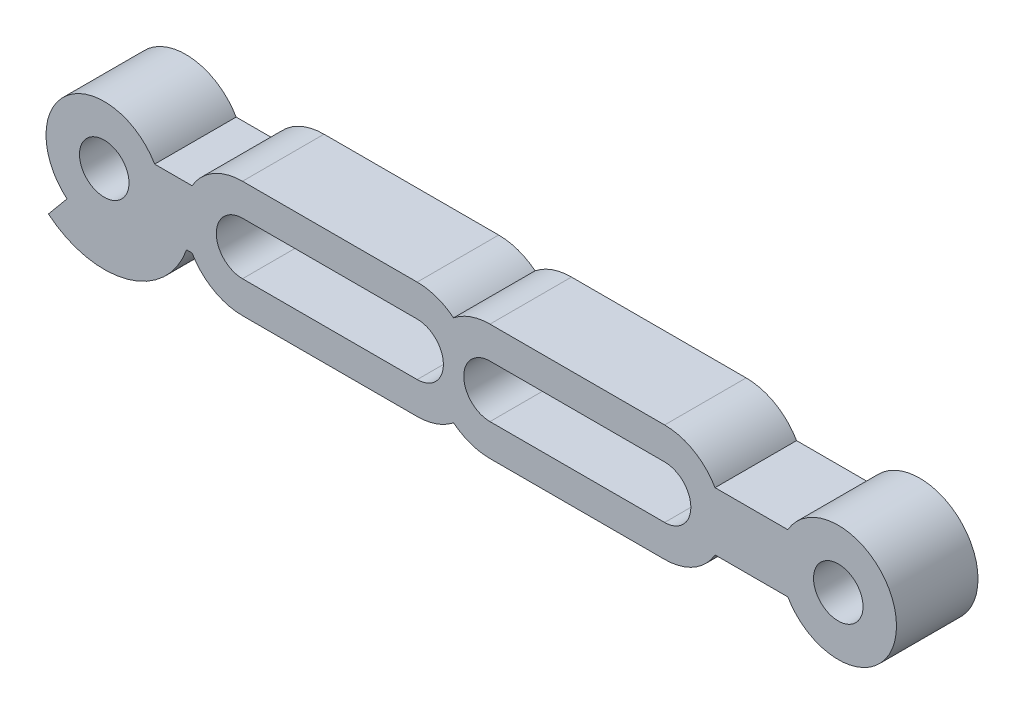
ISO-10303-21;
HEADER;
FILE_DESCRIPTION(('STEP AP214'),'2;1');
FILE_NAME('part.step','',(''),(''),'','','');
FILE_SCHEMA(('AUTOMOTIVE_DESIGN { 1 0 10303 214 1 1 1 1 }'));
ENDSEC;
DATA;
#1=APPLICATION_CONTEXT('core data for automotive mechanical design processes');
#2=APPLICATION_PROTOCOL_DEFINITION('international standard','automotive_design',2000,#1);
#3=PRODUCT_CONTEXT('',#1,'mechanical');
#4=PRODUCT('Part','Part','',(#3));
#5=PRODUCT_RELATED_PRODUCT_CATEGORY('part','',(#4));
#6=PRODUCT_DEFINITION_FORMATION('','',#4);
#7=PRODUCT_DEFINITION_CONTEXT('part definition',#1,'design');
#8=PRODUCT_DEFINITION('design','',#6,#7);
#9=PRODUCT_DEFINITION_SHAPE('','',#8);
#10=(LENGTH_UNIT() NAMED_UNIT(*) SI_UNIT(.MILLI.,.METRE.));
#11=(NAMED_UNIT(*) PLANE_ANGLE_UNIT() SI_UNIT($,.RADIAN.));
#12=(NAMED_UNIT(*) SI_UNIT($,.STERADIAN.) SOLID_ANGLE_UNIT());
#13=UNCERTAINTY_MEASURE_WITH_UNIT(LENGTH_MEASURE(1.E-05),#10,'distance_accuracy_value','');
#14=(GEOMETRIC_REPRESENTATION_CONTEXT(3) GLOBAL_UNCERTAINTY_ASSIGNED_CONTEXT((#13)) GLOBAL_UNIT_ASSIGNED_CONTEXT((#10,
#11,#12)) REPRESENTATION_CONTEXT('',''));
#15=CARTESIAN_POINT('',(0.,0.,0.));
#16=DIRECTION('',(0.,0.,1.));
#17=DIRECTION('',(1.,0.,0.));
#18=AXIS2_PLACEMENT_3D('',#15,#16,#17);
#19=CARTESIAN_POINT('',(29.,0.,5.6));
#20=DIRECTION('',(0.,0.,1.));
#21=DIRECTION('',(1.,0.,0.));
#22=AXIS2_PLACEMENT_3D('',#19,#20,#21);
#23=PLANE('',#22);
#24=CARTESIAN_POINT('',(40.9282032302755,0.,5.6));
#25=DIRECTION('',(0.,0.,1.));
#26=DIRECTION('',(1.,0.,0.));
#27=AXIS2_PLACEMENT_3D('',#24,#25,#26);
#28=CIRCLE('',#27,1.7);
#29=CARTESIAN_POINT('',(42.6282032302755,0.,5.6));
#30=VERTEX_POINT('',#29);
#31=EDGE_CURVE('E255',#30,#30,#28,.T.);
#32=ORIENTED_EDGE('',*,*,#31,.F.);
#33=EDGE_LOOP('',(#32));
#34=FACE_BOUND('',#33,.T.);
#35=CARTESIAN_POINT('',(29.,0.,5.6));
#36=DIRECTION('',(0.,0.,1.));
#37=DIRECTION('',(1.,0.,0.));
#38=AXIS2_PLACEMENT_3D('',#35,#36,#37);
#39=CIRCLE('',#38,4.);
#40=CARTESIAN_POINT('',(32.4641016151378,2.,5.6));
#41=VERTEX_POINT('',#40);
#42=CARTESIAN_POINT('',(29.,4.,5.6));
#43=VERTEX_POINT('',#42);
#44=EDGE_CURVE('E296',#41,#43,#39,.T.);
#45=ORIENTED_EDGE('',*,*,#44,.T.);
#46=DIRECTION('',(-1.,0.,0.));
#47=VECTOR('',#46,1.);
#48=CARTESIAN_POINT('',(17.,4.,5.6));
#49=LINE('',#48,#47);
#50=CARTESIAN_POINT('',(17.,4.,5.6));
#51=VERTEX_POINT('',#50);
#52=EDGE_CURVE('E299',#43,#51,#49,.T.);
#53=ORIENTED_EDGE('',*,*,#52,.T.);
#54=CARTESIAN_POINT('',(17.,0.,5.6));
#55=DIRECTION('',(0.,0.,1.));
#56=DIRECTION('',(1.,0.,0.));
#57=AXIS2_PLACEMENT_3D('',#54,#55,#56);
#58=CIRCLE('',#57,4.);
#59=CARTESIAN_POINT('',(14.5,3.1224989991992,5.6));
#60=VERTEX_POINT('',#59);
#61=EDGE_CURVE('E302',#51,#60,#58,.T.);
#62=ORIENTED_EDGE('',*,*,#61,.T.);
#63=CARTESIAN_POINT('',(12.,0.,5.6));
#64=DIRECTION('',(0.,0.,1.));
#65=DIRECTION('',(1.,0.,0.));
#66=AXIS2_PLACEMENT_3D('',#63,#64,#65);
#67=CIRCLE('',#66,4.);
#68=CARTESIAN_POINT('',(12.,4.,5.6));
#69=VERTEX_POINT('',#68);
#70=EDGE_CURVE('E304',#60,#69,#67,.T.);
#71=ORIENTED_EDGE('',*,*,#70,.T.);
#72=DIRECTION('',(-1.,0.,0.));
#73=VECTOR('',#72,1.);
#74=CARTESIAN_POINT('',(0.,4.,5.6));
#75=LINE('',#74,#73);
#76=CARTESIAN_POINT('',(0.,4.,5.6));
#77=VERTEX_POINT('',#76);
#78=EDGE_CURVE('E306',#69,#77,#75,.T.);
#79=ORIENTED_EDGE('',*,*,#78,.T.);
#80=CARTESIAN_POINT('',(0.,0.,5.6));
#81=DIRECTION('',(0.,0.,1.));
#82=DIRECTION('',(1.,0.,0.));
#83=AXIS2_PLACEMENT_3D('',#80,#81,#82);
#84=CIRCLE('',#83,4.);
#85=CARTESIAN_POINT('',(-3.46410161513775,2.,5.6));
#86=VERTEX_POINT('',#85);
#87=EDGE_CURVE('E308',#77,#86,#84,.T.);
#88=ORIENTED_EDGE('',*,*,#87,.T.);
#89=DIRECTION('',(-1.,0.,0.));
#90=VECTOR('',#89,1.);
#91=CARTESIAN_POINT('',(-3.84314575050762,2.,5.6));
#92=LINE('',#91,#90);
#93=CARTESIAN_POINT('',(-6.03589838486224,2.,5.6));
#94=VERTEX_POINT('',#93);
#95=EDGE_CURVE('E310',#86,#94,#92,.T.);
#96=ORIENTED_EDGE('',*,*,#95,.T.);
#97=CARTESIAN_POINT('',(-9.5,0.,5.6));
#98=DIRECTION('',(0.,0.,1.));
#99=DIRECTION('',(1.,0.,0.));
#100=AXIS2_PLACEMENT_3D('',#97,#98,#99);
#101=CIRCLE('',#100,4.);
#102=CARTESIAN_POINT('',(-12.0559528696348,-3.07686608876725,5.6));
#103=VERTEX_POINT('',#102);
#104=EDGE_CURVE('E312',#94,#103,#101,.T.);
#105=ORIENTED_EDGE('',*,*,#104,.T.);
#106=DIRECTION('',(-0.638988217408689,-0.769216522191812,0.));
#107=VECTOR('',#106,1.);
#108=CARTESIAN_POINT('',(-12.0559528696348,-3.07686608876725,5.6));
#109=LINE('',#108,#107);
#110=CARTESIAN_POINT('',(-13.3339293044521,-4.61529913315087,5.6));
#111=VERTEX_POINT('',#110);
#112=EDGE_CURVE('E314',#103,#111,#109,.T.);
#113=ORIENTED_EDGE('',*,*,#112,.T.);
#114=CARTESIAN_POINT('',(-9.5,0.,5.6));
#115=DIRECTION('',(0.,0.,1.));
#116=DIRECTION('',(1.,0.,0.));
#117=AXIS2_PLACEMENT_3D('',#114,#115,#116);
#118=CIRCLE('',#117,6.);
#119=CARTESIAN_POINT('',(-3.84314575050762,-2.,5.6));
#120=VERTEX_POINT('',#119);
#121=EDGE_CURVE('E316',#111,#120,#118,.T.);
#122=ORIENTED_EDGE('',*,*,#121,.T.);
#123=DIRECTION('',(1.,0.,0.));
#124=VECTOR('',#123,1.);
#125=CARTESIAN_POINT('',(-3.84314575050762,-2.,5.6));
#126=LINE('',#125,#124);
#127=CARTESIAN_POINT('',(-3.46410161513776,-2.,5.6));
#128=VERTEX_POINT('',#127);
#129=EDGE_CURVE('E318',#120,#128,#126,.T.);
#130=ORIENTED_EDGE('',*,*,#129,.T.);
#131=CARTESIAN_POINT('',(0.,0.,5.6));
#132=DIRECTION('',(0.,0.,1.));
#133=DIRECTION('',(1.,0.,0.));
#134=AXIS2_PLACEMENT_3D('',#131,#132,#133);
#135=CIRCLE('',#134,4.);
#136=CARTESIAN_POINT('',(0.,-4.,5.6));
#137=VERTEX_POINT('',#136);
#138=EDGE_CURVE('E320',#128,#137,#135,.T.);
#139=ORIENTED_EDGE('',*,*,#138,.T.);
#140=DIRECTION('',(1.,0.,0.));
#141=VECTOR('',#140,1.);
#142=CARTESIAN_POINT('',(0.,-4.,5.6));
#143=LINE('',#142,#141);
#144=CARTESIAN_POINT('',(12.,-4.,5.6));
#145=VERTEX_POINT('',#144);
#146=EDGE_CURVE('E322',#137,#145,#143,.T.);
#147=ORIENTED_EDGE('',*,*,#146,.T.);
#148=CARTESIAN_POINT('',(12.,0.,5.6));
#149=DIRECTION('',(0.,0.,1.));
#150=DIRECTION('',(1.,0.,0.));
#151=AXIS2_PLACEMENT_3D('',#148,#149,#150);
#152=CIRCLE('',#151,4.);
#153=CARTESIAN_POINT('',(14.5,-3.1224989991992,5.6));
#154=VERTEX_POINT('',#153);
#155=EDGE_CURVE('E324',#145,#154,#152,.T.);
#156=ORIENTED_EDGE('',*,*,#155,.T.);
#157=CARTESIAN_POINT('',(17.,0.,5.6));
#158=DIRECTION('',(0.,0.,1.));
#159=DIRECTION('',(1.,0.,0.));
#160=AXIS2_PLACEMENT_3D('',#157,#158,#159);
#161=CIRCLE('',#160,4.);
#162=CARTESIAN_POINT('',(17.,-4.,5.6));
#163=VERTEX_POINT('',#162);
#164=EDGE_CURVE('E326',#154,#163,#161,.T.);
#165=ORIENTED_EDGE('',*,*,#164,.T.);
#166=DIRECTION('',(1.,0.,0.));
#167=VECTOR('',#166,1.);
#168=CARTESIAN_POINT('',(17.,-4.,5.6));
#169=LINE('',#168,#167);
#170=CARTESIAN_POINT('',(29.,-4.,5.6));
#171=VERTEX_POINT('',#170);
#172=EDGE_CURVE('E328',#163,#171,#169,.T.);
#173=ORIENTED_EDGE('',*,*,#172,.T.);
#174=CARTESIAN_POINT('',(29.,0.,5.6));
#175=DIRECTION('',(0.,0.,1.));
#176=DIRECTION('',(1.,0.,0.));
#177=AXIS2_PLACEMENT_3D('',#174,#175,#176);
#178=CIRCLE('',#177,4.);
#179=CARTESIAN_POINT('',(32.4641016151378,-2.,5.6));
#180=VERTEX_POINT('',#179);
#181=EDGE_CURVE('E330',#171,#180,#178,.T.);
#182=ORIENTED_EDGE('',*,*,#181,.T.);
#183=DIRECTION('',(1.,0.,0.));
#184=VECTOR('',#183,1.);
#185=CARTESIAN_POINT('',(32.4641016151378,-2.,5.6));
#186=LINE('',#185,#184);
#187=CARTESIAN_POINT('',(37.4641016151377,-2.,5.6));
#188=VERTEX_POINT('',#187);
#189=EDGE_CURVE('E332',#180,#188,#186,.T.);
#190=ORIENTED_EDGE('',*,*,#189,.T.);
#191=CARTESIAN_POINT('',(40.9282032302755,0.,5.6));
#192=DIRECTION('',(0.,0.,1.));
#193=DIRECTION('',(1.,0.,0.));
#194=AXIS2_PLACEMENT_3D('',#191,#192,#193);
#195=CIRCLE('',#194,4.);
#196=CARTESIAN_POINT('',(37.4641016151377,2.,5.6));
#197=VERTEX_POINT('',#196);
#198=EDGE_CURVE('E334',#188,#197,#195,.T.);
#199=ORIENTED_EDGE('',*,*,#198,.T.);
#200=DIRECTION('',(-1.,0.,0.));
#201=VECTOR('',#200,1.);
#202=CARTESIAN_POINT('',(32.4641016151378,2.,5.6));
#203=LINE('',#202,#201);
#204=EDGE_CURVE('E336',#197,#41,#203,.T.);
#205=ORIENTED_EDGE('',*,*,#204,.T.);
#206=EDGE_LOOP('',(#45,#53,#62,#71,#79,#88,#96,#105,#113,#122,#130,#139,#147,#156,#165,#173,
#182,#190,#199,#205));
#207=FACE_BOUND('',#206,.T.);
#208=DIRECTION('',(1.,0.,0.));
#209=VECTOR('',#208,1.);
#210=CARTESIAN_POINT('',(17.,-1.8,5.6));
#211=LINE('',#210,#209);
#212=CARTESIAN_POINT('',(17.,-1.8,5.6));
#213=VERTEX_POINT('',#212);
#214=CARTESIAN_POINT('',(29.,-1.8,5.6));
#215=VERTEX_POINT('',#214);
#216=EDGE_CURVE('E267',#213,#215,#211,.T.);
#217=ORIENTED_EDGE('',*,*,#216,.F.);
#218=CARTESIAN_POINT('',(17.,0.,5.6));
#219=DIRECTION('',(0.,0.,1.));
#220=DIRECTION('',(1.,0.,0.));
#221=AXIS2_PLACEMENT_3D('',#218,#219,#220);
#222=CIRCLE('',#221,1.8);
#223=CARTESIAN_POINT('',(17.,1.8,5.6));
#224=VERTEX_POINT('',#223);
#225=EDGE_CURVE('E265',#224,#213,#222,.T.);
#226=ORIENTED_EDGE('',*,*,#225,.F.);
#227=DIRECTION('',(-1.,0.,0.));
#228=VECTOR('',#227,1.);
#229=CARTESIAN_POINT('',(17.,1.8,5.6));
#230=LINE('',#229,#228);
#231=CARTESIAN_POINT('',(29.,1.8,5.6));
#232=VERTEX_POINT('',#231);
#233=EDGE_CURVE('E273',#232,#224,#230,.T.);
#234=ORIENTED_EDGE('',*,*,#233,.F.);
#235=CARTESIAN_POINT('',(29.,0.,5.6));
#236=DIRECTION('',(0.,0.,1.));
#237=DIRECTION('',(1.,0.,0.));
#238=AXIS2_PLACEMENT_3D('',#235,#236,#237);
#239=CIRCLE('',#238,1.8);
#240=EDGE_CURVE('E270',#215,#232,#239,.T.);
#241=ORIENTED_EDGE('',*,*,#240,.F.);
#242=EDGE_LOOP('',(#217,#226,#234,#241));
#243=FACE_BOUND('',#242,.T.);
#244=DIRECTION('',(1.,0.,0.));
#245=VECTOR('',#244,1.);
#246=CARTESIAN_POINT('',(0.,-1.8,5.6));
#247=LINE('',#246,#245);
#248=CARTESIAN_POINT('',(0.,-1.8,5.6));
#249=VERTEX_POINT('',#248);
#250=CARTESIAN_POINT('',(12.,-1.8,5.6));
#251=VERTEX_POINT('',#250);
#252=EDGE_CURVE('E234',#249,#251,#247,.T.);
#253=ORIENTED_EDGE('',*,*,#252,.F.);
#254=CARTESIAN_POINT('',(0.,0.,5.6));
#255=DIRECTION('',(0.,0.,1.));
#256=DIRECTION('',(1.,0.,0.));
#257=AXIS2_PLACEMENT_3D('',#254,#255,#256);
#258=CIRCLE('',#257,1.8);
#259=CARTESIAN_POINT('',(0.,1.8,5.6));
#260=VERTEX_POINT('',#259);
#261=EDGE_CURVE('E226',#260,#249,#258,.T.);
#262=ORIENTED_EDGE('',*,*,#261,.F.);
#263=DIRECTION('',(-1.,0.,0.));
#264=VECTOR('',#263,1.);
#265=CARTESIAN_POINT('',(0.,1.8,5.6));
#266=LINE('',#265,#264);
#267=CARTESIAN_POINT('',(12.,1.8,5.6));
#268=VERTEX_POINT('',#267);
#269=EDGE_CURVE('E249',#268,#260,#266,.T.);
#270=ORIENTED_EDGE('',*,*,#269,.F.);
#271=CARTESIAN_POINT('',(12.,0.,5.6));
#272=DIRECTION('',(0.,0.,1.));
#273=DIRECTION('',(1.,0.,0.));
#274=AXIS2_PLACEMENT_3D('',#271,#272,#273);
#275=CIRCLE('',#274,1.8);
#276=EDGE_CURVE('E247',#251,#268,#275,.T.);
#277=ORIENTED_EDGE('',*,*,#276,.F.);
#278=EDGE_LOOP('',(#253,#262,#270,#277));
#279=FACE_BOUND('',#278,.T.);
#280=CARTESIAN_POINT('',(-9.5,0.,5.6));
#281=DIRECTION('',(0.,0.,1.));
#282=DIRECTION('',(1.,0.,0.));
#283=AXIS2_PLACEMENT_3D('',#280,#281,#282);
#284=CIRCLE('',#283,1.7);
#285=CARTESIAN_POINT('',(-7.8,0.,5.6));
#286=VERTEX_POINT('',#285);
#287=EDGE_CURVE('E814',#286,#286,#284,.T.);
#288=ORIENTED_EDGE('',*,*,#287,.F.);
#289=EDGE_LOOP('',(#288));
#290=FACE_BOUND('',#289,.T.);
#291=ADVANCED_FACE('F41',(#34,#207,#243,#279,#290),#23,.T.);
#292=CARTESIAN_POINT('',(29.,0.,0.));
#293=DIRECTION('',(0.,0.,1.));
#294=DIRECTION('',(1.,0.,0.));
#295=AXIS2_PLACEMENT_3D('',#292,#293,#294);
#296=PLANE('',#295);
#297=CARTESIAN_POINT('',(17.,0.,0.));
#298=DIRECTION('',(0.,0.,1.));
#299=DIRECTION('',(1.,0.,0.));
#300=AXIS2_PLACEMENT_3D('',#297,#298,#299);
#301=CIRCLE('',#300,1.8);
#302=CARTESIAN_POINT('',(17.,1.8,0.));
#303=VERTEX_POINT('',#302);
#304=CARTESIAN_POINT('',(17.,-1.8,0.));
#305=VERTEX_POINT('',#304);
#306=EDGE_CURVE('E242',#303,#305,#301,.T.);
#307=ORIENTED_EDGE('',*,*,#306,.T.);
#308=DIRECTION('',(1.,0.,0.));
#309=VECTOR('',#308,1.);
#310=CARTESIAN_POINT('',(17.,-1.8,0.));
#311=LINE('',#310,#309);
#312=CARTESIAN_POINT('',(29.,-1.8,0.));
#313=VERTEX_POINT('',#312);
#314=EDGE_CURVE('E278',#305,#313,#311,.T.);
#315=ORIENTED_EDGE('',*,*,#314,.T.);
#316=CARTESIAN_POINT('',(29.,0.,0.));
#317=DIRECTION('',(0.,0.,1.));
#318=DIRECTION('',(1.,0.,0.));
#319=AXIS2_PLACEMENT_3D('',#316,#317,#318);
#320=CIRCLE('',#319,1.8);
#321=CARTESIAN_POINT('',(29.,1.8,0.));
#322=VERTEX_POINT('',#321);
#323=EDGE_CURVE('E281',#313,#322,#320,.T.);
#324=ORIENTED_EDGE('',*,*,#323,.T.);
#325=DIRECTION('',(-1.,0.,0.));
#326=VECTOR('',#325,1.);
#327=CARTESIAN_POINT('',(17.,1.8,0.));
#328=LINE('',#327,#326);
#329=EDGE_CURVE('E268',#322,#303,#328,.T.);
#330=ORIENTED_EDGE('',*,*,#329,.T.);
#331=EDGE_LOOP('',(#307,#315,#324,#330));
#332=FACE_BOUND('',#331,.T.);
#333=CARTESIAN_POINT('',(29.,0.,0.));
#334=DIRECTION('',(0.,0.,1.));
#335=DIRECTION('',(1.,0.,0.));
#336=AXIS2_PLACEMENT_3D('',#333,#334,#335);
#337=CIRCLE('',#336,4.);
#338=CARTESIAN_POINT('',(32.4641016151378,2.,0.));
#339=VERTEX_POINT('',#338);
#340=CARTESIAN_POINT('',(29.,4.,0.));
#341=VERTEX_POINT('',#340);
#342=EDGE_CURVE('E295',#339,#341,#337,.T.);
#343=ORIENTED_EDGE('',*,*,#342,.F.);
#344=DIRECTION('',(-1.,0.,0.));
#345=VECTOR('',#344,1.);
#346=CARTESIAN_POINT('',(32.4641016151378,2.,0.));
#347=LINE('',#346,#345);
#348=CARTESIAN_POINT('',(37.4641016151377,2.,0.));
#349=VERTEX_POINT('',#348);
#350=EDGE_CURVE('E300',#349,#339,#347,.T.);
#351=ORIENTED_EDGE('',*,*,#350,.F.);
#352=CARTESIAN_POINT('',(40.9282032302755,0.,0.));
#353=DIRECTION('',(0.,0.,1.));
#354=DIRECTION('',(1.,0.,0.));
#355=AXIS2_PLACEMENT_3D('',#352,#353,#354);
#356=CIRCLE('',#355,4.);
#357=CARTESIAN_POINT('',(37.4641016151377,-2.,0.));
#358=VERTEX_POINT('',#357);
#359=EDGE_CURVE('E377',#358,#349,#356,.T.);
#360=ORIENTED_EDGE('',*,*,#359,.F.);
#361=DIRECTION('',(1.,0.,0.));
#362=VECTOR('',#361,1.);
#363=CARTESIAN_POINT('',(32.4641016151378,-2.,0.));
#364=LINE('',#363,#362);
#365=CARTESIAN_POINT('',(32.4641016151378,-2.,0.));
#366=VERTEX_POINT('',#365);
#367=EDGE_CURVE('E375',#366,#358,#364,.T.);
#368=ORIENTED_EDGE('',*,*,#367,.F.);
#369=CARTESIAN_POINT('',(29.,0.,0.));
#370=DIRECTION('',(0.,0.,1.));
#371=DIRECTION('',(1.,0.,0.));
#372=AXIS2_PLACEMENT_3D('',#369,#370,#371);
#373=CIRCLE('',#372,4.);
#374=CARTESIAN_POINT('',(29.,-4.,0.));
#375=VERTEX_POINT('',#374);
#376=EDGE_CURVE('E373',#375,#366,#373,.T.);
#377=ORIENTED_EDGE('',*,*,#376,.F.);
#378=DIRECTION('',(1.,0.,0.));
#379=VECTOR('',#378,1.);
#380=CARTESIAN_POINT('',(17.,-4.,0.));
#381=LINE('',#380,#379);
#382=CARTESIAN_POINT('',(17.,-4.,0.));
#383=VERTEX_POINT('',#382);
#384=EDGE_CURVE('E371',#383,#375,#381,.T.);
#385=ORIENTED_EDGE('',*,*,#384,.F.);
#386=CARTESIAN_POINT('',(17.,0.,0.));
#387=DIRECTION('',(0.,0.,1.));
#388=DIRECTION('',(1.,0.,0.));
#389=AXIS2_PLACEMENT_3D('',#386,#387,#388);
#390=CIRCLE('',#389,4.);
#391=CARTESIAN_POINT('',(14.5,-3.1224989991992,0.));
#392=VERTEX_POINT('',#391);
#393=EDGE_CURVE('E369',#392,#383,#390,.T.);
#394=ORIENTED_EDGE('',*,*,#393,.F.);
#395=CARTESIAN_POINT('',(12.,0.,0.));
#396=DIRECTION('',(0.,0.,1.));
#397=DIRECTION('',(1.,0.,0.));
#398=AXIS2_PLACEMENT_3D('',#395,#396,#397);
#399=CIRCLE('',#398,4.);
#400=CARTESIAN_POINT('',(12.,-4.,0.));
#401=VERTEX_POINT('',#400);
#402=EDGE_CURVE('E367',#401,#392,#399,.T.);
#403=ORIENTED_EDGE('',*,*,#402,.F.);
#404=DIRECTION('',(1.,0.,0.));
#405=VECTOR('',#404,1.);
#406=CARTESIAN_POINT('',(0.,-4.,0.));
#407=LINE('',#406,#405);
#408=CARTESIAN_POINT('',(0.,-4.,0.));
#409=VERTEX_POINT('',#408);
#410=EDGE_CURVE('E365',#409,#401,#407,.T.);
#411=ORIENTED_EDGE('',*,*,#410,.F.);
#412=CARTESIAN_POINT('',(0.,0.,0.));
#413=DIRECTION('',(0.,0.,1.));
#414=DIRECTION('',(1.,0.,0.));
#415=AXIS2_PLACEMENT_3D('',#412,#413,#414);
#416=CIRCLE('',#415,4.);
#417=CARTESIAN_POINT('',(-3.46410161513776,-2.,0.));
#418=VERTEX_POINT('',#417);
#419=EDGE_CURVE('E363',#418,#409,#416,.T.);
#420=ORIENTED_EDGE('',*,*,#419,.F.);
#421=DIRECTION('',(1.,0.,0.));
#422=VECTOR('',#421,1.);
#423=CARTESIAN_POINT('',(-3.84314575050762,-2.,0.));
#424=LINE('',#423,#422);
#425=CARTESIAN_POINT('',(-3.84314575050762,-2.,0.));
#426=VERTEX_POINT('',#425);
#427=EDGE_CURVE('E361',#426,#418,#424,.T.);
#428=ORIENTED_EDGE('',*,*,#427,.F.);
#429=CARTESIAN_POINT('',(-9.5,0.,0.));
#430=DIRECTION('',(0.,0.,1.));
#431=DIRECTION('',(1.,0.,0.));
#432=AXIS2_PLACEMENT_3D('',#429,#430,#431);
#433=CIRCLE('',#432,6.);
#434=CARTESIAN_POINT('',(-13.3339293044521,-4.61529913315087,0.));
#435=VERTEX_POINT('',#434);
#436=EDGE_CURVE('E359',#435,#426,#433,.T.);
#437=ORIENTED_EDGE('',*,*,#436,.F.);
#438=DIRECTION('',(-0.638988217408689,-0.769216522191812,0.));
#439=VECTOR('',#438,1.);
#440=CARTESIAN_POINT('',(-12.0559528696348,-3.07686608876725,0.));
#441=LINE('',#440,#439);
#442=CARTESIAN_POINT('',(-12.0559528696348,-3.07686608876725,0.));
#443=VERTEX_POINT('',#442);
#444=EDGE_CURVE('E357',#443,#435,#441,.T.);
#445=ORIENTED_EDGE('',*,*,#444,.F.);
#446=CARTESIAN_POINT('',(-9.5,0.,0.));
#447=DIRECTION('',(0.,0.,1.));
#448=DIRECTION('',(1.,0.,0.));
#449=AXIS2_PLACEMENT_3D('',#446,#447,#448);
#450=CIRCLE('',#449,4.);
#451=CARTESIAN_POINT('',(-6.03589838486224,2.,0.));
#452=VERTEX_POINT('',#451);
#453=EDGE_CURVE('E355',#452,#443,#450,.T.);
#454=ORIENTED_EDGE('',*,*,#453,.F.);
#455=DIRECTION('',(-1.,0.,0.));
#456=VECTOR('',#455,1.);
#457=CARTESIAN_POINT('',(-3.84314575050762,2.,0.));
#458=LINE('',#457,#456);
#459=CARTESIAN_POINT('',(-3.46410161513775,2.,0.));
#460=VERTEX_POINT('',#459);
#461=EDGE_CURVE('E352',#460,#452,#458,.T.);
#462=ORIENTED_EDGE('',*,*,#461,.F.);
#463=CARTESIAN_POINT('',(0.,0.,0.));
#464=DIRECTION('',(0.,0.,1.));
#465=DIRECTION('',(1.,0.,0.));
#466=AXIS2_PLACEMENT_3D('',#463,#464,#465);
#467=CIRCLE('',#466,4.);
#468=CARTESIAN_POINT('',(0.,4.,0.));
#469=VERTEX_POINT('',#468);
#470=EDGE_CURVE('E349',#469,#460,#467,.T.);
#471=ORIENTED_EDGE('',*,*,#470,.F.);
#472=DIRECTION('',(-1.,0.,0.));
#473=VECTOR('',#472,1.);
#474=CARTESIAN_POINT('',(0.,4.,0.));
#475=LINE('',#474,#473);
#476=CARTESIAN_POINT('',(12.,4.,0.));
#477=VERTEX_POINT('',#476);
#478=EDGE_CURVE('E347',#477,#469,#475,.T.);
#479=ORIENTED_EDGE('',*,*,#478,.F.);
#480=CARTESIAN_POINT('',(12.,0.,0.));
#481=DIRECTION('',(0.,0.,1.));
#482=DIRECTION('',(1.,0.,0.));
#483=AXIS2_PLACEMENT_3D('',#480,#481,#482);
#484=CIRCLE('',#483,4.);
#485=CARTESIAN_POINT('',(14.5,3.1224989991992,0.));
#486=VERTEX_POINT('',#485);
#487=EDGE_CURVE('E345',#486,#477,#484,.T.);
#488=ORIENTED_EDGE('',*,*,#487,.F.);
#489=CARTESIAN_POINT('',(17.,0.,0.));
#490=DIRECTION('',(0.,0.,1.));
#491=DIRECTION('',(1.,0.,0.));
#492=AXIS2_PLACEMENT_3D('',#489,#490,#491);
#493=CIRCLE('',#492,4.);
#494=CARTESIAN_POINT('',(17.,4.,0.));
#495=VERTEX_POINT('',#494);
#496=EDGE_CURVE('E343',#495,#486,#493,.T.);
#497=ORIENTED_EDGE('',*,*,#496,.F.);
#498=DIRECTION('',(-1.,0.,0.));
#499=VECTOR('',#498,1.);
#500=CARTESIAN_POINT('',(17.,4.,0.));
#501=LINE('',#500,#499);
#502=EDGE_CURVE('E341',#341,#495,#501,.T.);
#503=ORIENTED_EDGE('',*,*,#502,.F.);
#504=EDGE_LOOP('',(#343,#351,#360,#368,#377,#385,#394,#403,#411,#420,#428,#437,#445,#454,#462,
#471,#479,#488,#497,#503));
#505=FACE_BOUND('',#504,.T.);
#506=CARTESIAN_POINT('',(0.,0.,0.));
#507=DIRECTION('',(0.,0.,1.));
#508=DIRECTION('',(1.,0.,0.));
#509=AXIS2_PLACEMENT_3D('',#506,#507,#508);
#510=CIRCLE('',#509,1.8);
#511=CARTESIAN_POINT('',(0.,1.8,0.));
#512=VERTEX_POINT('',#511);
#513=CARTESIAN_POINT('',(0.,-1.8,0.));
#514=VERTEX_POINT('',#513);
#515=EDGE_CURVE('E64',#512,#514,#510,.T.);
#516=ORIENTED_EDGE('',*,*,#515,.T.);
#517=DIRECTION('',(1.,0.,0.));
#518=VECTOR('',#517,1.);
#519=CARTESIAN_POINT('',(0.,-1.8,0.));
#520=LINE('',#519,#518);
#521=CARTESIAN_POINT('',(12.,-1.8,0.));
#522=VERTEX_POINT('',#521);
#523=EDGE_CURVE('E241',#514,#522,#520,.T.);
#524=ORIENTED_EDGE('',*,*,#523,.T.);
#525=CARTESIAN_POINT('',(12.,0.,0.));
#526=DIRECTION('',(0.,0.,1.));
#527=DIRECTION('',(1.,0.,0.));
#528=AXIS2_PLACEMENT_3D('',#525,#526,#527);
#529=CIRCLE('',#528,1.8);
#530=CARTESIAN_POINT('',(12.,1.8,0.));
#531=VERTEX_POINT('',#530);
#532=EDGE_CURVE('E257',#522,#531,#529,.T.);
#533=ORIENTED_EDGE('',*,*,#532,.T.);
#534=DIRECTION('',(-1.,0.,0.));
#535=VECTOR('',#534,1.);
#536=CARTESIAN_POINT('',(0.,1.8,0.));
#537=LINE('',#536,#535);
#538=EDGE_CURVE('E235',#531,#512,#537,.T.);
#539=ORIENTED_EDGE('',*,*,#538,.T.);
#540=EDGE_LOOP('',(#516,#524,#533,#539));
#541=FACE_BOUND('',#540,.T.);
#542=CARTESIAN_POINT('',(40.9282032302755,0.,0.));
#543=DIRECTION('',(0.,0.,1.));
#544=DIRECTION('',(1.,0.,0.));
#545=AXIS2_PLACEMENT_3D('',#542,#543,#544);
#546=CIRCLE('',#545,1.7);
#547=CARTESIAN_POINT('',(42.6282032302755,0.,0.));
#548=VERTEX_POINT('',#547);
#549=EDGE_CURVE('E820',#548,#548,#546,.T.);
#550=ORIENTED_EDGE('',*,*,#549,.T.);
#551=EDGE_LOOP('',(#550));
#552=FACE_BOUND('',#551,.T.);
#553=CARTESIAN_POINT('',(-9.5,0.,0.));
#554=DIRECTION('',(0.,0.,1.));
#555=DIRECTION('',(1.,0.,0.));
#556=AXIS2_PLACEMENT_3D('',#553,#554,#555);
#557=CIRCLE('',#556,1.7);
#558=CARTESIAN_POINT('',(-7.8,0.,0.));
#559=VERTEX_POINT('',#558);
#560=EDGE_CURVE('E817',#559,#559,#557,.T.);
#561=ORIENTED_EDGE('',*,*,#560,.T.);
#562=EDGE_LOOP('',(#561));
#563=FACE_BOUND('',#562,.T.);
#564=ADVANCED_FACE('F443',(#332,#505,#541,#552,#563),#296,.F.);
#565=CARTESIAN_POINT('',(29.,0.,5.6));
#566=DIRECTION('',(0.,0.,-1.));
#567=DIRECTION('',(-1.,0.,0.));
#568=AXIS2_PLACEMENT_3D('',#565,#566,#567);
#569=CYLINDRICAL_SURFACE('',#568,4.);
#570=ORIENTED_EDGE('',*,*,#342,.T.);
#571=DIRECTION('',(0.,0.,-1.));
#572=VECTOR('',#571,1.);
#573=CARTESIAN_POINT('',(29.,4.,5.6));
#574=LINE('',#573,#572);
#575=EDGE_CURVE('E11',#43,#341,#574,.T.);
#576=ORIENTED_EDGE('',*,*,#575,.F.);
#577=ORIENTED_EDGE('',*,*,#44,.F.);
#578=DIRECTION('',(0.,0.,-1.));
#579=VECTOR('',#578,1.);
#580=CARTESIAN_POINT('',(32.4641016151378,2.,5.6));
#581=LINE('',#580,#579);
#582=EDGE_CURVE('E338',#41,#339,#581,.T.);
#583=ORIENTED_EDGE('',*,*,#582,.T.);
#584=EDGE_LOOP('',(#570,#576,#577,#583));
#585=FACE_BOUND('',#584,.T.);
#586=ADVANCED_FACE('F43',(#585),#569,.T.);
#587=CARTESIAN_POINT('',(17.,4.,5.6));
#588=DIRECTION('',(0.,-1.,0.));
#589=DIRECTION('',(0.,0.,-1.));
#590=AXIS2_PLACEMENT_3D('',#587,#588,#589);
#591=PLANE('',#590);
#592=ORIENTED_EDGE('',*,*,#502,.T.);
#593=DIRECTION('',(0.,0.,-1.));
#594=VECTOR('',#593,1.);
#595=CARTESIAN_POINT('',(17.,4.,5.6));
#596=LINE('',#595,#594);
#597=EDGE_CURVE('E49',#51,#495,#596,.T.);
#598=ORIENTED_EDGE('',*,*,#597,.F.);
#599=ORIENTED_EDGE('',*,*,#52,.F.);
#600=ORIENTED_EDGE('',*,*,#575,.T.);
#601=EDGE_LOOP('',(#592,#598,#599,#600));
#602=FACE_BOUND('',#601,.T.);
#603=ADVANCED_FACE('F461',(#602),#591,.F.);
#604=CARTESIAN_POINT('',(17.,0.,5.6));
#605=DIRECTION('',(0.,0.,-1.));
#606=DIRECTION('',(-1.,0.,0.));
#607=AXIS2_PLACEMENT_3D('',#604,#605,#606);
#608=CYLINDRICAL_SURFACE('',#607,4.);
#609=ORIENTED_EDGE('',*,*,#496,.T.);
#610=DIRECTION('',(0.,0.,-1.));
#611=VECTOR('',#610,1.);
#612=CARTESIAN_POINT('',(14.5,3.1224989991992,5.6));
#613=LINE('',#612,#611);
#614=EDGE_CURVE('E430',#60,#486,#613,.T.);
#615=ORIENTED_EDGE('',*,*,#614,.F.);
#616=ORIENTED_EDGE('',*,*,#61,.F.);
#617=ORIENTED_EDGE('',*,*,#597,.T.);
#618=EDGE_LOOP('',(#609,#615,#616,#617));
#619=FACE_BOUND('',#618,.T.);
#620=ADVANCED_FACE('F437',(#619),#608,.T.);
#621=CARTESIAN_POINT('',(12.,0.,5.6));
#622=DIRECTION('',(0.,0.,-1.));
#623=DIRECTION('',(-1.,0.,0.));
#624=AXIS2_PLACEMENT_3D('',#621,#622,#623);
#625=CYLINDRICAL_SURFACE('',#624,4.);
#626=ORIENTED_EDGE('',*,*,#487,.T.);
#627=DIRECTION('',(0.,0.,-1.));
#628=VECTOR('',#627,1.);
#629=CARTESIAN_POINT('',(12.,4.,5.6));
#630=LINE('',#629,#628);
#631=EDGE_CURVE('E427',#69,#477,#630,.T.);
#632=ORIENTED_EDGE('',*,*,#631,.F.);
#633=ORIENTED_EDGE('',*,*,#70,.F.);
#634=ORIENTED_EDGE('',*,*,#614,.T.);
#635=EDGE_LOOP('',(#626,#632,#633,#634));
#636=FACE_BOUND('',#635,.T.);
#637=ADVANCED_FACE('F449',(#636),#625,.T.);
#638=CARTESIAN_POINT('',(0.,4.,5.6));
#639=DIRECTION('',(0.,-1.,0.));
#640=DIRECTION('',(1.,0.,0.));
#641=AXIS2_PLACEMENT_3D('',#638,#639,#640);
#642=PLANE('',#641);
#643=ORIENTED_EDGE('',*,*,#478,.T.);
#644=DIRECTION('',(0.,0.,-1.));
#645=VECTOR('',#644,1.);
#646=CARTESIAN_POINT('',(0.,4.,5.6));
#647=LINE('',#646,#645);
#648=EDGE_CURVE('E424',#77,#469,#647,.T.);
#649=ORIENTED_EDGE('',*,*,#648,.F.);
#650=ORIENTED_EDGE('',*,*,#78,.F.);
#651=ORIENTED_EDGE('',*,*,#631,.T.);
#652=EDGE_LOOP('',(#643,#649,#650,#651));
#653=FACE_BOUND('',#652,.T.);
#654=ADVANCED_FACE('F453',(#653),#642,.F.);
#655=CARTESIAN_POINT('',(0.,0.,5.6));
#656=DIRECTION('',(0.,0.,-1.));
#657=DIRECTION('',(-1.,0.,0.));
#658=AXIS2_PLACEMENT_3D('',#655,#656,#657);
#659=CYLINDRICAL_SURFACE('',#658,4.);
#660=ORIENTED_EDGE('',*,*,#470,.T.);
#661=DIRECTION('',(0.,0.,-1.));
#662=VECTOR('',#661,1.);
#663=CARTESIAN_POINT('',(-3.46410161513775,2.,5.6));
#664=LINE('',#663,#662);
#665=EDGE_CURVE('E421',#86,#460,#664,.T.);
#666=ORIENTED_EDGE('',*,*,#665,.F.);
#667=ORIENTED_EDGE('',*,*,#87,.F.);
#668=ORIENTED_EDGE('',*,*,#648,.T.);
#669=EDGE_LOOP('',(#660,#666,#667,#668));
#670=FACE_BOUND('',#669,.T.);
#671=ADVANCED_FACE('F538',(#670),#659,.T.);
#672=CARTESIAN_POINT('',(-3.84314575050762,2.,5.6));
#673=DIRECTION('',(0.,-1.,0.));
#674=DIRECTION('',(1.,0.,0.));
#675=AXIS2_PLACEMENT_3D('',#672,#673,#674);
#676=PLANE('',#675);
#677=ORIENTED_EDGE('',*,*,#461,.T.);
#678=DIRECTION('',(0.,0.,-1.));
#679=VECTOR('',#678,1.);
#680=CARTESIAN_POINT('',(-6.03589838486224,2.,5.6));
#681=LINE('',#680,#679);
#682=EDGE_CURVE('E418',#94,#452,#681,.T.);
#683=ORIENTED_EDGE('',*,*,#682,.F.);
#684=ORIENTED_EDGE('',*,*,#95,.F.);
#685=ORIENTED_EDGE('',*,*,#665,.T.);
#686=EDGE_LOOP('',(#677,#683,#684,#685));
#687=FACE_BOUND('',#686,.T.);
#688=ADVANCED_FACE('F527',(#687),#676,.F.);
#689=CARTESIAN_POINT('',(-9.5,0.,5.6));
#690=DIRECTION('',(0.,0.,-1.));
#691=DIRECTION('',(-1.,0.,0.));
#692=AXIS2_PLACEMENT_3D('',#689,#690,#691);
#693=CYLINDRICAL_SURFACE('',#692,4.);
#694=ORIENTED_EDGE('',*,*,#453,.T.);
#695=DIRECTION('',(0.,0.,-1.));
#696=VECTOR('',#695,1.);
#697=CARTESIAN_POINT('',(-12.0559528696348,-3.07686608876725,5.6));
#698=LINE('',#697,#696);
#699=EDGE_CURVE('E415',#103,#443,#698,.T.);
#700=ORIENTED_EDGE('',*,*,#699,.F.);
#701=ORIENTED_EDGE('',*,*,#104,.F.);
#702=ORIENTED_EDGE('',*,*,#682,.T.);
#703=EDGE_LOOP('',(#694,#700,#701,#702));
#704=FACE_BOUND('',#703,.T.);
#705=ADVANCED_FACE('F530',(#704),#693,.T.);
#706=CARTESIAN_POINT('',(-12.0559528696348,-3.07686608876725,5.6));
#707=DIRECTION('',(0.769216522191811,-0.638988217408689,0.));
#708=DIRECTION('',(0.638988217408689,0.769216522191812,0.));
#709=AXIS2_PLACEMENT_3D('',#706,#707,#708);
#710=PLANE('',#709);
#711=ORIENTED_EDGE('',*,*,#444,.T.);
#712=DIRECTION('',(0.,0.,-1.));
#713=VECTOR('',#712,1.);
#714=CARTESIAN_POINT('',(-13.3339293044521,-4.61529913315087,5.6));
#715=LINE('',#714,#713);
#716=EDGE_CURVE('E412',#111,#435,#715,.T.);
#717=ORIENTED_EDGE('',*,*,#716,.F.);
#718=ORIENTED_EDGE('',*,*,#112,.F.);
#719=ORIENTED_EDGE('',*,*,#699,.T.);
#720=EDGE_LOOP('',(#711,#717,#718,#719));
#721=FACE_BOUND('',#720,.T.);
#722=ADVANCED_FACE('F522',(#721),#710,.F.);
#723=CARTESIAN_POINT('',(-9.5,0.,5.6));
#724=DIRECTION('',(0.,0.,-1.));
#725=DIRECTION('',(-1.,0.,0.));
#726=AXIS2_PLACEMENT_3D('',#723,#724,#725);
#727=CYLINDRICAL_SURFACE('',#726,6.);
#728=ORIENTED_EDGE('',*,*,#436,.T.);
#729=DIRECTION('',(0.,0.,-1.));
#730=VECTOR('',#729,1.);
#731=CARTESIAN_POINT('',(-3.84314575050762,-2.,5.6));
#732=LINE('',#731,#730);
#733=EDGE_CURVE('E409',#120,#426,#732,.T.);
#734=ORIENTED_EDGE('',*,*,#733,.F.);
#735=ORIENTED_EDGE('',*,*,#121,.F.);
#736=ORIENTED_EDGE('',*,*,#716,.T.);
#737=EDGE_LOOP('',(#728,#734,#735,#736));
#738=FACE_BOUND('',#737,.T.);
#739=ADVANCED_FACE('F518',(#738),#727,.T.);
#740=CARTESIAN_POINT('',(-3.84314575050762,-2.,5.6));
#741=DIRECTION('',(0.,1.,0.));
#742=DIRECTION('',(-1.,0.,0.));
#743=AXIS2_PLACEMENT_3D('',#740,#741,#742);
#744=PLANE('',#743);
#745=ORIENTED_EDGE('',*,*,#427,.T.);
#746=DIRECTION('',(0.,0.,-1.));
#747=VECTOR('',#746,1.);
#748=CARTESIAN_POINT('',(-3.46410161513776,-2.,5.6));
#749=LINE('',#748,#747);
#750=EDGE_CURVE('E406',#128,#418,#749,.T.);
#751=ORIENTED_EDGE('',*,*,#750,.F.);
#752=ORIENTED_EDGE('',*,*,#129,.F.);
#753=ORIENTED_EDGE('',*,*,#733,.T.);
#754=EDGE_LOOP('',(#745,#751,#752,#753));
#755=FACE_BOUND('',#754,.T.);
#756=ADVANCED_FACE('F513',(#755),#744,.F.);
#757=CARTESIAN_POINT('',(0.,0.,5.6));
#758=DIRECTION('',(0.,0.,-1.));
#759=DIRECTION('',(-1.,0.,0.));
#760=AXIS2_PLACEMENT_3D('',#757,#758,#759);
#761=CYLINDRICAL_SURFACE('',#760,4.);
#762=ORIENTED_EDGE('',*,*,#419,.T.);
#763=DIRECTION('',(0.,0.,-1.));
#764=VECTOR('',#763,1.);
#765=CARTESIAN_POINT('',(0.,-4.,5.6));
#766=LINE('',#765,#764);
#767=EDGE_CURVE('E403',#137,#409,#766,.T.);
#768=ORIENTED_EDGE('',*,*,#767,.F.);
#769=ORIENTED_EDGE('',*,*,#138,.F.);
#770=ORIENTED_EDGE('',*,*,#750,.T.);
#771=EDGE_LOOP('',(#762,#768,#769,#770));
#772=FACE_BOUND('',#771,.T.);
#773=ADVANCED_FACE('F507',(#772),#761,.T.);
#774=CARTESIAN_POINT('',(0.,-4.,5.6));
#775=DIRECTION('',(0.,1.,0.));
#776=DIRECTION('',(-1.,0.,0.));
#777=AXIS2_PLACEMENT_3D('',#774,#775,#776);
#778=PLANE('',#777);
#779=ORIENTED_EDGE('',*,*,#410,.T.);
#780=DIRECTION('',(0.,0.,-1.));
#781=VECTOR('',#780,1.);
#782=CARTESIAN_POINT('',(12.,-4.,5.6));
#783=LINE('',#782,#781);
#784=EDGE_CURVE('E400',#145,#401,#783,.T.);
#785=ORIENTED_EDGE('',*,*,#784,.F.);
#786=ORIENTED_EDGE('',*,*,#146,.F.);
#787=ORIENTED_EDGE('',*,*,#767,.T.);
#788=EDGE_LOOP('',(#779,#785,#786,#787));
#789=FACE_BOUND('',#788,.T.);
#790=ADVANCED_FACE('F503',(#789),#778,.F.);
#791=CARTESIAN_POINT('',(12.,0.,5.6));
#792=DIRECTION('',(0.,0.,-1.));
#793=DIRECTION('',(-1.,0.,0.));
#794=AXIS2_PLACEMENT_3D('',#791,#792,#793);
#795=CYLINDRICAL_SURFACE('',#794,4.);
#796=ORIENTED_EDGE('',*,*,#402,.T.);
#797=DIRECTION('',(0.,0.,-1.));
#798=VECTOR('',#797,1.);
#799=CARTESIAN_POINT('',(14.5,-3.1224989991992,5.6));
#800=LINE('',#799,#798);
#801=EDGE_CURVE('E397',#154,#392,#800,.T.);
#802=ORIENTED_EDGE('',*,*,#801,.F.);
#803=ORIENTED_EDGE('',*,*,#155,.F.);
#804=ORIENTED_EDGE('',*,*,#784,.T.);
#805=EDGE_LOOP('',(#796,#802,#803,#804));
#806=FACE_BOUND('',#805,.T.);
#807=ADVANCED_FACE('F498',(#806),#795,.T.);
#808=CARTESIAN_POINT('',(17.,0.,5.6));
#809=DIRECTION('',(0.,0.,-1.));
#810=DIRECTION('',(-1.,0.,0.));
#811=AXIS2_PLACEMENT_3D('',#808,#809,#810);
#812=CYLINDRICAL_SURFACE('',#811,4.);
#813=ORIENTED_EDGE('',*,*,#393,.T.);
#814=DIRECTION('',(0.,0.,-1.));
#815=VECTOR('',#814,1.);
#816=CARTESIAN_POINT('',(17.,-4.,5.6));
#817=LINE('',#816,#815);
#818=EDGE_CURVE('E394',#163,#383,#817,.T.);
#819=ORIENTED_EDGE('',*,*,#818,.F.);
#820=ORIENTED_EDGE('',*,*,#164,.F.);
#821=ORIENTED_EDGE('',*,*,#801,.T.);
#822=EDGE_LOOP('',(#813,#819,#820,#821));
#823=FACE_BOUND('',#822,.T.);
#824=ADVANCED_FACE('F492',(#823),#812,.T.);
#825=CARTESIAN_POINT('',(17.,-4.,5.6));
#826=DIRECTION('',(0.,1.,0.));
#827=DIRECTION('',(0.,0.,1.));
#828=AXIS2_PLACEMENT_3D('',#825,#826,#827);
#829=PLANE('',#828);
#830=ORIENTED_EDGE('',*,*,#384,.T.);
#831=DIRECTION('',(0.,0.,-1.));
#832=VECTOR('',#831,1.);
#833=CARTESIAN_POINT('',(29.,-4.,5.6));
#834=LINE('',#833,#832);
#835=EDGE_CURVE('E391',#171,#375,#834,.T.);
#836=ORIENTED_EDGE('',*,*,#835,.F.);
#837=ORIENTED_EDGE('',*,*,#172,.F.);
#838=ORIENTED_EDGE('',*,*,#818,.T.);
#839=EDGE_LOOP('',(#830,#836,#837,#838));
#840=FACE_BOUND('',#839,.T.);
#841=ADVANCED_FACE('F488',(#840),#829,.F.);
#842=CARTESIAN_POINT('',(29.,0.,5.6));
#843=DIRECTION('',(0.,0.,-1.));
#844=DIRECTION('',(-1.,0.,0.));
#845=AXIS2_PLACEMENT_3D('',#842,#843,#844);
#846=CYLINDRICAL_SURFACE('',#845,4.);
#847=ORIENTED_EDGE('',*,*,#376,.T.);
#848=DIRECTION('',(0.,0.,-1.));
#849=VECTOR('',#848,1.);
#850=CARTESIAN_POINT('',(32.4641016151378,-2.,5.6));
#851=LINE('',#850,#849);
#852=EDGE_CURVE('E388',#180,#366,#851,.T.);
#853=ORIENTED_EDGE('',*,*,#852,.F.);
#854=ORIENTED_EDGE('',*,*,#181,.F.);
#855=ORIENTED_EDGE('',*,*,#835,.T.);
#856=EDGE_LOOP('',(#847,#853,#854,#855));
#857=FACE_BOUND('',#856,.T.);
#858=ADVANCED_FACE('F483',(#857),#846,.T.);
#859=CARTESIAN_POINT('',(32.4641016151378,-2.,5.6));
#860=DIRECTION('',(0.,1.,0.));
#861=DIRECTION('',(0.,0.,1.));
#862=AXIS2_PLACEMENT_3D('',#859,#860,#861);
#863=PLANE('',#862);
#864=ORIENTED_EDGE('',*,*,#367,.T.);
#865=DIRECTION('',(0.,0.,-1.));
#866=VECTOR('',#865,1.);
#867=CARTESIAN_POINT('',(37.4641016151377,-2.,5.6));
#868=LINE('',#867,#866);
#869=EDGE_CURVE('E385',#188,#358,#868,.T.);
#870=ORIENTED_EDGE('',*,*,#869,.F.);
#871=ORIENTED_EDGE('',*,*,#189,.F.);
#872=ORIENTED_EDGE('',*,*,#852,.T.);
#873=EDGE_LOOP('',(#864,#870,#871,#872));
#874=FACE_BOUND('',#873,.T.);
#875=ADVANCED_FACE('F477',(#874),#863,.F.);
#876=CARTESIAN_POINT('',(40.9282032302755,0.,5.6));
#877=DIRECTION('',(0.,0.,-1.));
#878=DIRECTION('',(-1.,0.,0.));
#879=AXIS2_PLACEMENT_3D('',#876,#877,#878);
#880=CYLINDRICAL_SURFACE('',#879,4.);
#881=ORIENTED_EDGE('',*,*,#359,.T.);
#882=DIRECTION('',(0.,0.,-1.));
#883=VECTOR('',#882,1.);
#884=CARTESIAN_POINT('',(37.4641016151377,2.,5.6));
#885=LINE('',#884,#883);
#886=EDGE_CURVE('E382',#197,#349,#885,.T.);
#887=ORIENTED_EDGE('',*,*,#886,.F.);
#888=ORIENTED_EDGE('',*,*,#198,.F.);
#889=ORIENTED_EDGE('',*,*,#869,.T.);
#890=EDGE_LOOP('',(#881,#887,#888,#889));
#891=FACE_BOUND('',#890,.T.);
#892=ADVANCED_FACE('F473',(#891),#880,.T.);
#893=CARTESIAN_POINT('',(32.4641016151378,2.,5.6));
#894=DIRECTION('',(0.,-1.,0.));
#895=DIRECTION('',(0.,0.,-1.));
#896=AXIS2_PLACEMENT_3D('',#893,#894,#895);
#897=PLANE('',#896);
#898=ORIENTED_EDGE('',*,*,#350,.T.);
#899=ORIENTED_EDGE('',*,*,#582,.F.);
#900=ORIENTED_EDGE('',*,*,#204,.F.);
#901=ORIENTED_EDGE('',*,*,#886,.T.);
#902=EDGE_LOOP('',(#898,#899,#900,#901));
#903=FACE_BOUND('',#902,.T.);
#904=ADVANCED_FACE('F468',(#903),#897,.F.);
#905=CARTESIAN_POINT('',(17.,0.,5.6));
#906=DIRECTION('',(0.,0.,-1.));
#907=DIRECTION('',(-1.,0.,0.));
#908=AXIS2_PLACEMENT_3D('',#905,#906,#907);
#909=CYLINDRICAL_SURFACE('',#908,1.8);
#910=ORIENTED_EDGE('',*,*,#306,.F.);
#911=DIRECTION('',(0.,0.,-1.));
#912=VECTOR('',#911,1.);
#913=CARTESIAN_POINT('',(17.,1.8,5.6));
#914=LINE('',#913,#912);
#915=EDGE_CURVE('E275',#224,#303,#914,.T.);
#916=ORIENTED_EDGE('',*,*,#915,.F.);
#917=ORIENTED_EDGE('',*,*,#225,.T.);
#918=DIRECTION('',(0.,0.,-1.));
#919=VECTOR('',#918,1.);
#920=CARTESIAN_POINT('',(17.,-1.8,5.6));
#921=LINE('',#920,#919);
#922=EDGE_CURVE('E292',#213,#305,#921,.T.);
#923=ORIENTED_EDGE('',*,*,#922,.T.);
#924=EDGE_LOOP('',(#910,#916,#917,#923));
#925=FACE_BOUND('',#924,.T.);
#926=ADVANCED_FACE('F550',(#925),#909,.F.);
#927=CARTESIAN_POINT('',(17.,-1.8,5.6));
#928=DIRECTION('',(0.,1.,0.));
#929=DIRECTION('',(-1.,0.,0.));
#930=AXIS2_PLACEMENT_3D('',#927,#928,#929);
#931=PLANE('',#930);
#932=ORIENTED_EDGE('',*,*,#314,.F.);
#933=ORIENTED_EDGE('',*,*,#922,.F.);
#934=ORIENTED_EDGE('',*,*,#216,.T.);
#935=DIRECTION('',(0.,0.,-1.));
#936=VECTOR('',#935,1.);
#937=CARTESIAN_POINT('',(29.,-1.8,5.6));
#938=LINE('',#937,#936);
#939=EDGE_CURVE('E290',#215,#313,#938,.T.);
#940=ORIENTED_EDGE('',*,*,#939,.T.);
#941=EDGE_LOOP('',(#932,#933,#934,#940));
#942=FACE_BOUND('',#941,.T.);
#943=ADVANCED_FACE('F635',(#942),#931,.T.);
#944=CARTESIAN_POINT('',(29.,0.,5.6));
#945=DIRECTION('',(0.,0.,-1.));
#946=DIRECTION('',(-1.,0.,0.));
#947=AXIS2_PLACEMENT_3D('',#944,#945,#946);
#948=CYLINDRICAL_SURFACE('',#947,1.8);
#949=ORIENTED_EDGE('',*,*,#323,.F.);
#950=ORIENTED_EDGE('',*,*,#939,.F.);
#951=ORIENTED_EDGE('',*,*,#240,.T.);
#952=DIRECTION('',(0.,0.,-1.));
#953=VECTOR('',#952,1.);
#954=CARTESIAN_POINT('',(29.,1.8,5.6));
#955=LINE('',#954,#953);
#956=EDGE_CURVE('E288',#232,#322,#955,.T.);
#957=ORIENTED_EDGE('',*,*,#956,.T.);
#958=EDGE_LOOP('',(#949,#950,#951,#957));
#959=FACE_BOUND('',#958,.T.);
#960=ADVANCED_FACE('F643',(#959),#948,.F.);
#961=CARTESIAN_POINT('',(17.,1.8,5.6));
#962=DIRECTION('',(0.,-1.,0.));
#963=DIRECTION('',(1.,0.,0.));
#964=AXIS2_PLACEMENT_3D('',#961,#962,#963);
#965=PLANE('',#964);
#966=ORIENTED_EDGE('',*,*,#329,.F.);
#967=ORIENTED_EDGE('',*,*,#956,.F.);
#968=ORIENTED_EDGE('',*,*,#233,.T.);
#969=ORIENTED_EDGE('',*,*,#915,.T.);
#970=EDGE_LOOP('',(#966,#967,#968,#969));
#971=FACE_BOUND('',#970,.T.);
#972=ADVANCED_FACE('F651',(#971),#965,.T.);
#973=CARTESIAN_POINT('',(0.,0.,5.6));
#974=DIRECTION('',(0.,0.,-1.));
#975=DIRECTION('',(-1.,0.,0.));
#976=AXIS2_PLACEMENT_3D('',#973,#974,#975);
#977=CYLINDRICAL_SURFACE('',#976,1.8);
#978=ORIENTED_EDGE('',*,*,#515,.F.);
#979=DIRECTION('',(0.,0.,-1.));
#980=VECTOR('',#979,1.);
#981=CARTESIAN_POINT('',(0.,1.8,5.6));
#982=LINE('',#981,#980);
#983=EDGE_CURVE('E230',#260,#512,#982,.T.);
#984=ORIENTED_EDGE('',*,*,#983,.F.);
#985=ORIENTED_EDGE('',*,*,#261,.T.);
#986=DIRECTION('',(0.,0.,-1.));
#987=VECTOR('',#986,1.);
#988=CARTESIAN_POINT('',(0.,-1.8,5.6));
#989=LINE('',#988,#987);
#990=EDGE_CURVE('E229',#249,#514,#989,.T.);
#991=ORIENTED_EDGE('',*,*,#990,.T.);
#992=EDGE_LOOP('',(#978,#984,#985,#991));
#993=FACE_BOUND('',#992,.T.);
#994=ADVANCED_FACE('F228',(#993),#977,.F.);
#995=CARTESIAN_POINT('',(0.,-1.8,5.6));
#996=DIRECTION('',(0.,1.,0.));
#997=DIRECTION('',(-1.,0.,0.));
#998=AXIS2_PLACEMENT_3D('',#995,#996,#997);
#999=PLANE('',#998);
#1000=ORIENTED_EDGE('',*,*,#523,.F.);
#1001=ORIENTED_EDGE('',*,*,#990,.F.);
#1002=ORIENTED_EDGE('',*,*,#252,.T.);
#1003=DIRECTION('',(0.,0.,-1.));
#1004=VECTOR('',#1003,1.);
#1005=CARTESIAN_POINT('',(12.,-1.8,5.6));
#1006=LINE('',#1005,#1004);
#1007=EDGE_CURVE('E243',#251,#522,#1006,.T.);
#1008=ORIENTED_EDGE('',*,*,#1007,.T.);
#1009=EDGE_LOOP('',(#1000,#1001,#1002,#1008));
#1010=FACE_BOUND('',#1009,.T.);
#1011=ADVANCED_FACE('F238',(#1010),#999,.T.);
#1012=CARTESIAN_POINT('',(12.,0.,5.6));
#1013=DIRECTION('',(0.,0.,-1.));
#1014=DIRECTION('',(-1.,0.,0.));
#1015=AXIS2_PLACEMENT_3D('',#1012,#1013,#1014);
#1016=CYLINDRICAL_SURFACE('',#1015,1.8);
#1017=ORIENTED_EDGE('',*,*,#532,.F.);
#1018=ORIENTED_EDGE('',*,*,#1007,.F.);
#1019=ORIENTED_EDGE('',*,*,#276,.T.);
#1020=DIRECTION('',(0.,0.,-1.));
#1021=VECTOR('',#1020,1.);
#1022=CARTESIAN_POINT('',(12.,1.8,5.6));
#1023=LINE('',#1022,#1021);
#1024=EDGE_CURVE('E56',#268,#531,#1023,.T.);
#1025=ORIENTED_EDGE('',*,*,#1024,.T.);
#1026=EDGE_LOOP('',(#1017,#1018,#1019,#1025));
#1027=FACE_BOUND('',#1026,.T.);
#1028=ADVANCED_FACE('F675',(#1027),#1016,.F.);
#1029=CARTESIAN_POINT('',(0.,1.8,5.6));
#1030=DIRECTION('',(0.,-1.,0.));
#1031=DIRECTION('',(1.,0.,0.));
#1032=AXIS2_PLACEMENT_3D('',#1029,#1030,#1031);
#1033=PLANE('',#1032);
#1034=ORIENTED_EDGE('',*,*,#538,.F.);
#1035=ORIENTED_EDGE('',*,*,#1024,.F.);
#1036=ORIENTED_EDGE('',*,*,#269,.T.);
#1037=ORIENTED_EDGE('',*,*,#983,.T.);
#1038=EDGE_LOOP('',(#1034,#1035,#1036,#1037));
#1039=FACE_BOUND('',#1038,.T.);
#1040=ADVANCED_FACE('F683',(#1039),#1033,.T.);
#1041=CARTESIAN_POINT('',(40.9282032302755,0.,5.6));
#1042=DIRECTION('',(0.,0.,-1.));
#1043=DIRECTION('',(-1.,0.,0.));
#1044=AXIS2_PLACEMENT_3D('',#1041,#1042,#1043);
#1045=CYLINDRICAL_SURFACE('',#1044,1.7);
#1046=ORIENTED_EDGE('',*,*,#31,.T.);
#1047=EDGE_LOOP('',(#1046));
#1048=FACE_BOUND('',#1047,.T.);
#1049=ORIENTED_EDGE('',*,*,#549,.F.);
#1050=EDGE_LOOP('',(#1049));
#1051=FACE_BOUND('',#1050,.T.);
#1052=ADVANCED_FACE('F692',(#1048,#1051),#1045,.F.);
#1053=CARTESIAN_POINT('',(-9.5,0.,5.6));
#1054=DIRECTION('',(0.,0.,-1.));
#1055=DIRECTION('',(-1.,0.,0.));
#1056=AXIS2_PLACEMENT_3D('',#1053,#1054,#1055);
#1057=CYLINDRICAL_SURFACE('',#1056,1.7);
#1058=ORIENTED_EDGE('',*,*,#287,.T.);
#1059=EDGE_LOOP('',(#1058));
#1060=FACE_BOUND('',#1059,.T.);
#1061=ORIENTED_EDGE('',*,*,#560,.F.);
#1062=EDGE_LOOP('',(#1061));
#1063=FACE_BOUND('',#1062,.T.);
#1064=ADVANCED_FACE('F700',(#1060,#1063),#1057,.F.);
#1065=CLOSED_SHELL('',(#291,#564,#586,#603,#620,#637,#654,#671,#688,#705,#722,#739,#756,#773,
#790,#807,#824,#841,#858,#875,#892,#904,#926,#943,#960,#972,#994,#1011,#1028,#1040,#1052,#1064));
#1066=MANIFOLD_SOLID_BREP('B2',#1065);
#1067=ADVANCED_BREP_SHAPE_REPRESENTATION('',(#18,#1066),#14);
#1068=SHAPE_DEFINITION_REPRESENTATION(#9,#1067);
ENDSEC;
END-ISO-10303-21;
